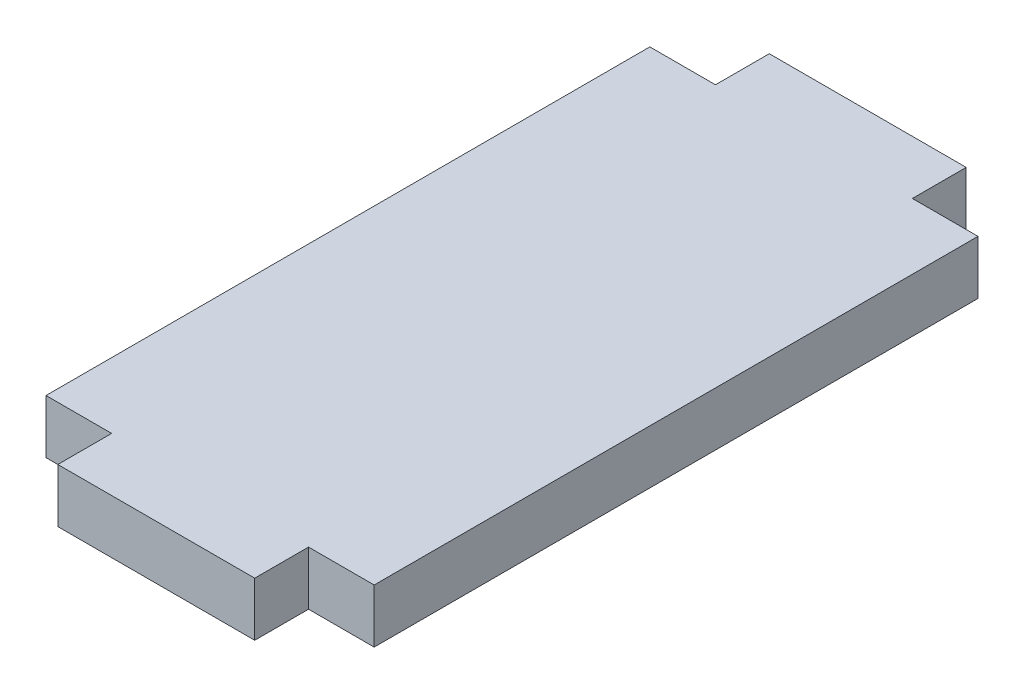
ISO-10303-21;
HEADER;
FILE_DESCRIPTION(('STEP AP214'),'2;1');
FILE_NAME('part.step','',(''),(''),'','','');
FILE_SCHEMA(('AUTOMOTIVE_DESIGN { 1 0 10303 214 1 1 1 1 }'));
ENDSEC;
DATA;
#1=APPLICATION_CONTEXT('core data for automotive mechanical design processes');
#2=APPLICATION_PROTOCOL_DEFINITION('international standard','automotive_design',2000,#1);
#3=PRODUCT_CONTEXT('',#1,'mechanical');
#4=PRODUCT('Part','Part','',(#3));
#5=PRODUCT_RELATED_PRODUCT_CATEGORY('part','',(#4));
#6=PRODUCT_DEFINITION_FORMATION('','',#4);
#7=PRODUCT_DEFINITION_CONTEXT('part definition',#1,'design');
#8=PRODUCT_DEFINITION('design','',#6,#7);
#9=PRODUCT_DEFINITION_SHAPE('','',#8);
#10=(LENGTH_UNIT() NAMED_UNIT(*) SI_UNIT(.MILLI.,.METRE.));
#11=(NAMED_UNIT(*) PLANE_ANGLE_UNIT() SI_UNIT($,.RADIAN.));
#12=(NAMED_UNIT(*) SI_UNIT($,.STERADIAN.) SOLID_ANGLE_UNIT());
#13=UNCERTAINTY_MEASURE_WITH_UNIT(LENGTH_MEASURE(1.E-05),#10,'distance_accuracy_value','');
#14=(GEOMETRIC_REPRESENTATION_CONTEXT(3) GLOBAL_UNCERTAINTY_ASSIGNED_CONTEXT((#13)) GLOBAL_UNIT_ASSIGNED_CONTEXT((#10,
#11,#12)) REPRESENTATION_CONTEXT('',''));
#15=CARTESIAN_POINT('',(0.,0.,0.));
#16=DIRECTION('',(0.,0.,1.));
#17=DIRECTION('',(1.,0.,0.));
#18=AXIS2_PLACEMENT_3D('',#15,#16,#17);
#19=CARTESIAN_POINT('',(7.5,4.1,-23.));
#20=DIRECTION('',(0.,0.,1.));
#21=DIRECTION('',(1.,0.,0.));
#22=AXIS2_PLACEMENT_3D('',#19,#20,#21);
#23=PLANE('',#22);
#24=DIRECTION('',(-1.,0.,0.));
#25=VECTOR('',#24,1.);
#26=CARTESIAN_POINT('',(7.5,0.,-23.));
#27=LINE('',#26,#25);
#28=CARTESIAN_POINT('',(12.5,0.,-23.));
#29=VERTEX_POINT('',#28);
#30=CARTESIAN_POINT('',(7.5,0.,-23.));
#31=VERTEX_POINT('',#30);
#32=EDGE_CURVE('E153',#29,#31,#27,.T.);
#33=ORIENTED_EDGE('',*,*,#32,.T.);
#34=DIRECTION('',(0.,-1.,0.));
#35=VECTOR('',#34,1.);
#36=CARTESIAN_POINT('',(7.5,4.1,-23.));
#37=LINE('',#36,#35);
#38=CARTESIAN_POINT('',(7.5,4.1,-23.));
#39=VERTEX_POINT('',#38);
#40=EDGE_CURVE('E11',#39,#31,#37,.T.);
#41=ORIENTED_EDGE('',*,*,#40,.F.);
#42=DIRECTION('',(-1.,0.,0.));
#43=VECTOR('',#42,1.);
#44=CARTESIAN_POINT('',(7.5,4.1,-23.));
#45=LINE('',#44,#43);
#46=CARTESIAN_POINT('',(12.5,4.1,-23.));
#47=VERTEX_POINT('',#46);
#48=EDGE_CURVE('E175',#47,#39,#45,.T.);
#49=ORIENTED_EDGE('',*,*,#48,.F.);
#50=DIRECTION('',(0.,-1.,0.));
#51=VECTOR('',#50,1.);
#52=CARTESIAN_POINT('',(12.5,4.1,-23.));
#53=LINE('',#52,#51);
#54=EDGE_CURVE('E149',#47,#29,#53,.T.);
#55=ORIENTED_EDGE('',*,*,#54,.T.);
#56=EDGE_LOOP('',(#33,#41,#49,#55));
#57=FACE_BOUND('',#56,.T.);
#58=ADVANCED_FACE('F33',(#57),#23,.F.);
#59=CARTESIAN_POINT('',(7.5,4.1,-23.));
#60=DIRECTION('',(-1.,0.,0.));
#61=DIRECTION('',(0.,0.,1.));
#62=AXIS2_PLACEMENT_3D('',#59,#60,#61);
#63=PLANE('',#62);
#64=DIRECTION('',(0.,0.,-1.));
#65=VECTOR('',#64,1.);
#66=CARTESIAN_POINT('',(7.5,0.,-23.));
#67=LINE('',#66,#65);
#68=CARTESIAN_POINT('',(7.5,0.,-27.1));
#69=VERTEX_POINT('',#68);
#70=EDGE_CURVE('E156',#31,#69,#67,.T.);
#71=ORIENTED_EDGE('',*,*,#70,.T.);
#72=DIRECTION('',(0.,-1.,0.));
#73=VECTOR('',#72,1.);
#74=CARTESIAN_POINT('',(7.5,4.1,-27.1));
#75=LINE('',#74,#73);
#76=CARTESIAN_POINT('',(7.5,4.1,-27.1));
#77=VERTEX_POINT('',#76);
#78=EDGE_CURVE('E41',#77,#69,#75,.T.);
#79=ORIENTED_EDGE('',*,*,#78,.F.);
#80=DIRECTION('',(0.,0.,-1.));
#81=VECTOR('',#80,1.);
#82=CARTESIAN_POINT('',(7.5,4.1,-23.));
#83=LINE('',#82,#81);
#84=EDGE_CURVE('E104',#39,#77,#83,.T.);
#85=ORIENTED_EDGE('',*,*,#84,.F.);
#86=ORIENTED_EDGE('',*,*,#40,.T.);
#87=EDGE_LOOP('',(#71,#79,#85,#86));
#88=FACE_BOUND('',#87,.T.);
#89=ADVANCED_FACE('F253',(#88),#63,.F.);
#90=CARTESIAN_POINT('',(-7.5,4.1,-27.1));
#91=DIRECTION('',(0.,0.,1.));
#92=DIRECTION('',(1.,0.,0.));
#93=AXIS2_PLACEMENT_3D('',#90,#91,#92);
#94=PLANE('',#93);
#95=DIRECTION('',(-1.,0.,0.));
#96=VECTOR('',#95,1.);
#97=CARTESIAN_POINT('',(-7.5,0.,-27.1));
#98=LINE('',#97,#96);
#99=CARTESIAN_POINT('',(-7.5,0.,-27.1));
#100=VERTEX_POINT('',#99);
#101=EDGE_CURVE('E158',#69,#100,#98,.T.);
#102=ORIENTED_EDGE('',*,*,#101,.T.);
#103=DIRECTION('',(0.,-1.,0.));
#104=VECTOR('',#103,1.);
#105=CARTESIAN_POINT('',(-7.5,4.1,-27.1));
#106=LINE('',#105,#104);
#107=CARTESIAN_POINT('',(-7.5,4.1,-27.1));
#108=VERTEX_POINT('',#107);
#109=EDGE_CURVE('E194',#108,#100,#106,.T.);
#110=ORIENTED_EDGE('',*,*,#109,.F.);
#111=DIRECTION('',(-1.,0.,0.));
#112=VECTOR('',#111,1.);
#113=CARTESIAN_POINT('',(-7.5,4.1,-27.1));
#114=LINE('',#113,#112);
#115=EDGE_CURVE('E202',#77,#108,#114,.T.);
#116=ORIENTED_EDGE('',*,*,#115,.F.);
#117=ORIENTED_EDGE('',*,*,#78,.T.);
#118=EDGE_LOOP('',(#102,#110,#116,#117));
#119=FACE_BOUND('',#118,.T.);
#120=ADVANCED_FACE('F200',(#119),#94,.F.);
#121=CARTESIAN_POINT('',(-7.5,4.1,-23.));
#122=DIRECTION('',(1.,0.,0.));
#123=DIRECTION('',(0.,0.,-1.));
#124=AXIS2_PLACEMENT_3D('',#121,#122,#123);
#125=PLANE('',#124);
#126=DIRECTION('',(0.,0.,1.));
#127=VECTOR('',#126,1.);
#128=CARTESIAN_POINT('',(-7.5,0.,-23.));
#129=LINE('',#128,#127);
#130=CARTESIAN_POINT('',(-7.5,0.,-23.));
#131=VERTEX_POINT('',#130);
#132=EDGE_CURVE('E160',#100,#131,#129,.T.);
#133=ORIENTED_EDGE('',*,*,#132,.T.);
#134=DIRECTION('',(0.,-1.,0.));
#135=VECTOR('',#134,1.);
#136=CARTESIAN_POINT('',(-7.5,4.1,-23.));
#137=LINE('',#136,#135);
#138=CARTESIAN_POINT('',(-7.5,4.1,-23.));
#139=VERTEX_POINT('',#138);
#140=EDGE_CURVE('E191',#139,#131,#137,.T.);
#141=ORIENTED_EDGE('',*,*,#140,.F.);
#142=DIRECTION('',(0.,0.,1.));
#143=VECTOR('',#142,1.);
#144=CARTESIAN_POINT('',(-7.5,4.1,-23.));
#145=LINE('',#144,#143);
#146=EDGE_CURVE('E220',#108,#139,#145,.T.);
#147=ORIENTED_EDGE('',*,*,#146,.F.);
#148=ORIENTED_EDGE('',*,*,#109,.T.);
#149=EDGE_LOOP('',(#133,#141,#147,#148));
#150=FACE_BOUND('',#149,.T.);
#151=ADVANCED_FACE('F211',(#150),#125,.F.);
#152=CARTESIAN_POINT('',(-12.5,4.1,-23.));
#153=DIRECTION('',(0.,0.,1.));
#154=DIRECTION('',(1.,0.,0.));
#155=AXIS2_PLACEMENT_3D('',#152,#153,#154);
#156=PLANE('',#155);
#157=DIRECTION('',(-1.,0.,0.));
#158=VECTOR('',#157,1.);
#159=CARTESIAN_POINT('',(-12.5,0.,-23.));
#160=LINE('',#159,#158);
#161=CARTESIAN_POINT('',(-12.5,0.,-23.));
#162=VERTEX_POINT('',#161);
#163=EDGE_CURVE('E162',#131,#162,#160,.T.);
#164=ORIENTED_EDGE('',*,*,#163,.T.);
#165=DIRECTION('',(0.,-1.,0.));
#166=VECTOR('',#165,1.);
#167=CARTESIAN_POINT('',(-12.5,4.1,-23.));
#168=LINE('',#167,#166);
#169=CARTESIAN_POINT('',(-12.5,4.1,-23.));
#170=VERTEX_POINT('',#169);
#171=EDGE_CURVE('E188',#170,#162,#168,.T.);
#172=ORIENTED_EDGE('',*,*,#171,.F.);
#173=DIRECTION('',(-1.,0.,0.));
#174=VECTOR('',#173,1.);
#175=CARTESIAN_POINT('',(-12.5,4.1,-23.));
#176=LINE('',#175,#174);
#177=EDGE_CURVE('E217',#139,#170,#176,.T.);
#178=ORIENTED_EDGE('',*,*,#177,.F.);
#179=ORIENTED_EDGE('',*,*,#140,.T.);
#180=EDGE_LOOP('',(#164,#172,#178,#179));
#181=FACE_BOUND('',#180,.T.);
#182=ADVANCED_FACE('F215',(#181),#156,.F.);
#183=CARTESIAN_POINT('',(-12.5,4.1,23.));
#184=DIRECTION('',(1.,0.,0.));
#185=DIRECTION('',(0.,0.,-1.));
#186=AXIS2_PLACEMENT_3D('',#183,#184,#185);
#187=PLANE('',#186);
#188=DIRECTION('',(0.,0.,1.));
#189=VECTOR('',#188,1.);
#190=CARTESIAN_POINT('',(-12.5,0.,23.));
#191=LINE('',#190,#189);
#192=CARTESIAN_POINT('',(-12.5,0.,23.));
#193=VERTEX_POINT('',#192);
#194=EDGE_CURVE('E164',#162,#193,#191,.T.);
#195=ORIENTED_EDGE('',*,*,#194,.T.);
#196=DIRECTION('',(0.,-1.,0.));
#197=VECTOR('',#196,1.);
#198=CARTESIAN_POINT('',(-12.5,4.1,23.));
#199=LINE('',#198,#197);
#200=CARTESIAN_POINT('',(-12.5,4.1,23.));
#201=VERTEX_POINT('',#200);
#202=EDGE_CURVE('E185',#201,#193,#199,.T.);
#203=ORIENTED_EDGE('',*,*,#202,.F.);
#204=DIRECTION('',(0.,0.,1.));
#205=VECTOR('',#204,1.);
#206=CARTESIAN_POINT('',(-12.5,4.1,23.));
#207=LINE('',#206,#205);
#208=EDGE_CURVE('E219',#170,#201,#207,.T.);
#209=ORIENTED_EDGE('',*,*,#208,.F.);
#210=ORIENTED_EDGE('',*,*,#171,.T.);
#211=EDGE_LOOP('',(#195,#203,#209,#210));
#212=FACE_BOUND('',#211,.T.);
#213=ADVANCED_FACE('F266',(#212),#187,.F.);
#214=CARTESIAN_POINT('',(-12.5,4.1,23.));
#215=DIRECTION('',(0.,0.,-1.));
#216=DIRECTION('',(-1.,0.,0.));
#217=AXIS2_PLACEMENT_3D('',#214,#215,#216);
#218=PLANE('',#217);
#219=DIRECTION('',(1.,0.,0.));
#220=VECTOR('',#219,1.);
#221=CARTESIAN_POINT('',(-12.5,0.,23.));
#222=LINE('',#221,#220);
#223=CARTESIAN_POINT('',(-7.5,0.,23.));
#224=VERTEX_POINT('',#223);
#225=EDGE_CURVE('E166',#193,#224,#222,.T.);
#226=ORIENTED_EDGE('',*,*,#225,.T.);
#227=DIRECTION('',(0.,-1.,0.));
#228=VECTOR('',#227,1.);
#229=CARTESIAN_POINT('',(-7.5,4.1,23.));
#230=LINE('',#229,#228);
#231=CARTESIAN_POINT('',(-7.5,4.1,23.));
#232=VERTEX_POINT('',#231);
#233=EDGE_CURVE('E182',#232,#224,#230,.T.);
#234=ORIENTED_EDGE('',*,*,#233,.F.);
#235=DIRECTION('',(1.,0.,0.));
#236=VECTOR('',#235,1.);
#237=CARTESIAN_POINT('',(-12.5,4.1,23.));
#238=LINE('',#237,#236);
#239=EDGE_CURVE('E222',#201,#232,#238,.T.);
#240=ORIENTED_EDGE('',*,*,#239,.F.);
#241=ORIENTED_EDGE('',*,*,#202,.T.);
#242=EDGE_LOOP('',(#226,#234,#240,#241));
#243=FACE_BOUND('',#242,.T.);
#244=ADVANCED_FACE('F269',(#243),#218,.F.);
#245=CARTESIAN_POINT('',(-7.5,4.1,23.));
#246=DIRECTION('',(1.,0.,0.));
#247=DIRECTION('',(0.,0.,-1.));
#248=AXIS2_PLACEMENT_3D('',#245,#246,#247);
#249=PLANE('',#248);
#250=DIRECTION('',(0.,0.,1.));
#251=VECTOR('',#250,1.);
#252=CARTESIAN_POINT('',(-7.5,0.,23.));
#253=LINE('',#252,#251);
#254=CARTESIAN_POINT('',(-7.5,0.,27.1));
#255=VERTEX_POINT('',#254);
#256=EDGE_CURVE('E168',#224,#255,#253,.T.);
#257=ORIENTED_EDGE('',*,*,#256,.T.);
#258=DIRECTION('',(0.,-1.,0.));
#259=VECTOR('',#258,1.);
#260=CARTESIAN_POINT('',(-7.5,4.1,27.1));
#261=LINE('',#260,#259);
#262=CARTESIAN_POINT('',(-7.5,4.1,27.1));
#263=VERTEX_POINT('',#262);
#264=EDGE_CURVE('E179',#263,#255,#261,.T.);
#265=ORIENTED_EDGE('',*,*,#264,.F.);
#266=DIRECTION('',(0.,0.,1.));
#267=VECTOR('',#266,1.);
#268=CARTESIAN_POINT('',(-7.5,4.1,23.));
#269=LINE('',#268,#267);
#270=EDGE_CURVE('E228',#232,#263,#269,.T.);
#271=ORIENTED_EDGE('',*,*,#270,.F.);
#272=ORIENTED_EDGE('',*,*,#233,.T.);
#273=EDGE_LOOP('',(#257,#265,#271,#272));
#274=FACE_BOUND('',#273,.T.);
#275=ADVANCED_FACE('F234',(#274),#249,.F.);
#276=CARTESIAN_POINT('',(-7.5,4.1,27.1));
#277=DIRECTION('',(0.,0.,-1.));
#278=DIRECTION('',(-1.,0.,0.));
#279=AXIS2_PLACEMENT_3D('',#276,#277,#278);
#280=PLANE('',#279);
#281=DIRECTION('',(1.,0.,0.));
#282=VECTOR('',#281,1.);
#283=CARTESIAN_POINT('',(-7.5,0.,27.1));
#284=LINE('',#283,#282);
#285=CARTESIAN_POINT('',(7.5,0.,27.1));
#286=VERTEX_POINT('',#285);
#287=EDGE_CURVE('E170',#255,#286,#284,.T.);
#288=ORIENTED_EDGE('',*,*,#287,.T.);
#289=DIRECTION('',(0.,-1.,0.));
#290=VECTOR('',#289,1.);
#291=CARTESIAN_POINT('',(7.5,4.1,27.1));
#292=LINE('',#291,#290);
#293=CARTESIAN_POINT('',(7.5,4.1,27.1));
#294=VERTEX_POINT('',#293);
#295=EDGE_CURVE('E144',#294,#286,#292,.T.);
#296=ORIENTED_EDGE('',*,*,#295,.F.);
#297=DIRECTION('',(1.,0.,0.));
#298=VECTOR('',#297,1.);
#299=CARTESIAN_POINT('',(-7.5,4.1,27.1));
#300=LINE('',#299,#298);
#301=EDGE_CURVE('E135',#263,#294,#300,.T.);
#302=ORIENTED_EDGE('',*,*,#301,.F.);
#303=ORIENTED_EDGE('',*,*,#264,.T.);
#304=EDGE_LOOP('',(#288,#296,#302,#303));
#305=FACE_BOUND('',#304,.T.);
#306=ADVANCED_FACE('F238',(#305),#280,.F.);
#307=CARTESIAN_POINT('',(7.5,4.1,23.));
#308=DIRECTION('',(-1.,0.,0.));
#309=DIRECTION('',(0.,0.,1.));
#310=AXIS2_PLACEMENT_3D('',#307,#308,#309);
#311=PLANE('',#310);
#312=DIRECTION('',(0.,0.,-1.));
#313=VECTOR('',#312,1.);
#314=CARTESIAN_POINT('',(7.5,0.,23.));
#315=LINE('',#314,#313);
#316=CARTESIAN_POINT('',(7.5,0.,23.));
#317=VERTEX_POINT('',#316);
#318=EDGE_CURVE('E143',#286,#317,#315,.T.);
#319=ORIENTED_EDGE('',*,*,#318,.T.);
#320=DIRECTION('',(0.,-1.,0.));
#321=VECTOR('',#320,1.);
#322=CARTESIAN_POINT('',(7.5,4.1,23.));
#323=LINE('',#322,#321);
#324=CARTESIAN_POINT('',(7.5,4.1,23.));
#325=VERTEX_POINT('',#324);
#326=EDGE_CURVE('E140',#325,#317,#323,.T.);
#327=ORIENTED_EDGE('',*,*,#326,.F.);
#328=DIRECTION('',(0.,0.,-1.));
#329=VECTOR('',#328,1.);
#330=CARTESIAN_POINT('',(7.5,4.1,23.));
#331=LINE('',#330,#329);
#332=EDGE_CURVE('E129',#294,#325,#331,.T.);
#333=ORIENTED_EDGE('',*,*,#332,.F.);
#334=ORIENTED_EDGE('',*,*,#295,.T.);
#335=EDGE_LOOP('',(#319,#327,#333,#334));
#336=FACE_BOUND('',#335,.T.);
#337=ADVANCED_FACE('F141',(#336),#311,.F.);
#338=CARTESIAN_POINT('',(7.5,4.1,23.));
#339=DIRECTION('',(0.,0.,-1.));
#340=DIRECTION('',(-1.,0.,0.));
#341=AXIS2_PLACEMENT_3D('',#338,#339,#340);
#342=PLANE('',#341);
#343=DIRECTION('',(1.,0.,0.));
#344=VECTOR('',#343,1.);
#345=CARTESIAN_POINT('',(7.5,0.,23.));
#346=LINE('',#345,#344);
#347=CARTESIAN_POINT('',(12.5,0.,23.));
#348=VERTEX_POINT('',#347);
#349=EDGE_CURVE('E90',#317,#348,#346,.T.);
#350=ORIENTED_EDGE('',*,*,#349,.T.);
#351=DIRECTION('',(0.,-1.,0.));
#352=VECTOR('',#351,1.);
#353=CARTESIAN_POINT('',(12.5,4.1,23.));
#354=LINE('',#353,#352);
#355=CARTESIAN_POINT('',(12.5,4.1,23.));
#356=VERTEX_POINT('',#355);
#357=EDGE_CURVE('E145',#356,#348,#354,.T.);
#358=ORIENTED_EDGE('',*,*,#357,.F.);
#359=DIRECTION('',(1.,0.,0.));
#360=VECTOR('',#359,1.);
#361=CARTESIAN_POINT('',(7.5,4.1,23.));
#362=LINE('',#361,#360);
#363=EDGE_CURVE('E133',#325,#356,#362,.T.);
#364=ORIENTED_EDGE('',*,*,#363,.F.);
#365=ORIENTED_EDGE('',*,*,#326,.T.);
#366=EDGE_LOOP('',(#350,#358,#364,#365));
#367=FACE_BOUND('',#366,.T.);
#368=ADVANCED_FACE('F147',(#367),#342,.F.);
#369=CARTESIAN_POINT('',(12.5,4.1,23.));
#370=DIRECTION('',(-1.,0.,0.));
#371=DIRECTION('',(0.,0.,1.));
#372=AXIS2_PLACEMENT_3D('',#369,#370,#371);
#373=PLANE('',#372);
#374=DIRECTION('',(0.,0.,-1.));
#375=VECTOR('',#374,1.);
#376=CARTESIAN_POINT('',(12.5,0.,23.));
#377=LINE('',#376,#375);
#378=EDGE_CURVE('E96',#348,#29,#377,.T.);
#379=ORIENTED_EDGE('',*,*,#378,.T.);
#380=ORIENTED_EDGE('',*,*,#54,.F.);
#381=DIRECTION('',(0.,0.,-1.));
#382=VECTOR('',#381,1.);
#383=CARTESIAN_POINT('',(12.5,4.1,23.));
#384=LINE('',#383,#382);
#385=EDGE_CURVE('E49',#356,#47,#384,.T.);
#386=ORIENTED_EDGE('',*,*,#385,.F.);
#387=ORIENTED_EDGE('',*,*,#357,.T.);
#388=EDGE_LOOP('',(#379,#380,#386,#387));
#389=FACE_BOUND('',#388,.T.);
#390=ADVANCED_FACE('F242',(#389),#373,.F.);
#391=CARTESIAN_POINT('',(12.5,4.1,-23.));
#392=DIRECTION('',(0.,1.,0.));
#393=DIRECTION('',(0.,0.,1.));
#394=AXIS2_PLACEMENT_3D('',#391,#392,#393);
#395=PLANE('',#394);
#396=ORIENTED_EDGE('',*,*,#48,.T.);
#397=ORIENTED_EDGE('',*,*,#84,.T.);
#398=ORIENTED_EDGE('',*,*,#115,.T.);
#399=ORIENTED_EDGE('',*,*,#146,.T.);
#400=ORIENTED_EDGE('',*,*,#177,.T.);
#401=ORIENTED_EDGE('',*,*,#208,.T.);
#402=ORIENTED_EDGE('',*,*,#239,.T.);
#403=ORIENTED_EDGE('',*,*,#270,.T.);
#404=ORIENTED_EDGE('',*,*,#301,.T.);
#405=ORIENTED_EDGE('',*,*,#332,.T.);
#406=ORIENTED_EDGE('',*,*,#363,.T.);
#407=ORIENTED_EDGE('',*,*,#385,.T.);
#408=EDGE_LOOP('',(#396,#397,#398,#399,#400,#401,#402,#403,#404,#405,#406,#407));
#409=FACE_BOUND('',#408,.T.);
#410=ADVANCED_FACE('F131',(#409),#395,.T.);
#411=CARTESIAN_POINT('',(12.5,0.,-23.));
#412=DIRECTION('',(0.,1.,0.));
#413=DIRECTION('',(0.,0.,1.));
#414=AXIS2_PLACEMENT_3D('',#411,#412,#413);
#415=PLANE('',#414);
#416=ORIENTED_EDGE('',*,*,#32,.F.);
#417=ORIENTED_EDGE('',*,*,#378,.F.);
#418=ORIENTED_EDGE('',*,*,#349,.F.);
#419=ORIENTED_EDGE('',*,*,#318,.F.);
#420=ORIENTED_EDGE('',*,*,#287,.F.);
#421=ORIENTED_EDGE('',*,*,#256,.F.);
#422=ORIENTED_EDGE('',*,*,#225,.F.);
#423=ORIENTED_EDGE('',*,*,#194,.F.);
#424=ORIENTED_EDGE('',*,*,#163,.F.);
#425=ORIENTED_EDGE('',*,*,#132,.F.);
#426=ORIENTED_EDGE('',*,*,#101,.F.);
#427=ORIENTED_EDGE('',*,*,#70,.F.);
#428=EDGE_LOOP('',(#416,#417,#418,#419,#420,#421,#422,#423,#424,#425,#426,#427));
#429=FACE_BOUND('',#428,.T.);
#430=ADVANCED_FACE('F206',(#429),#415,.F.);
#431=CLOSED_SHELL('',(#58,#89,#120,#151,#182,#213,#244,#275,#306,#337,#368,#390,#410,#430));
#432=MANIFOLD_SOLID_BREP('B2',#431);
#433=ADVANCED_BREP_SHAPE_REPRESENTATION('',(#18,#432),#14);
#434=SHAPE_DEFINITION_REPRESENTATION(#9,#433);
ENDSEC;
END-ISO-10303-21;
